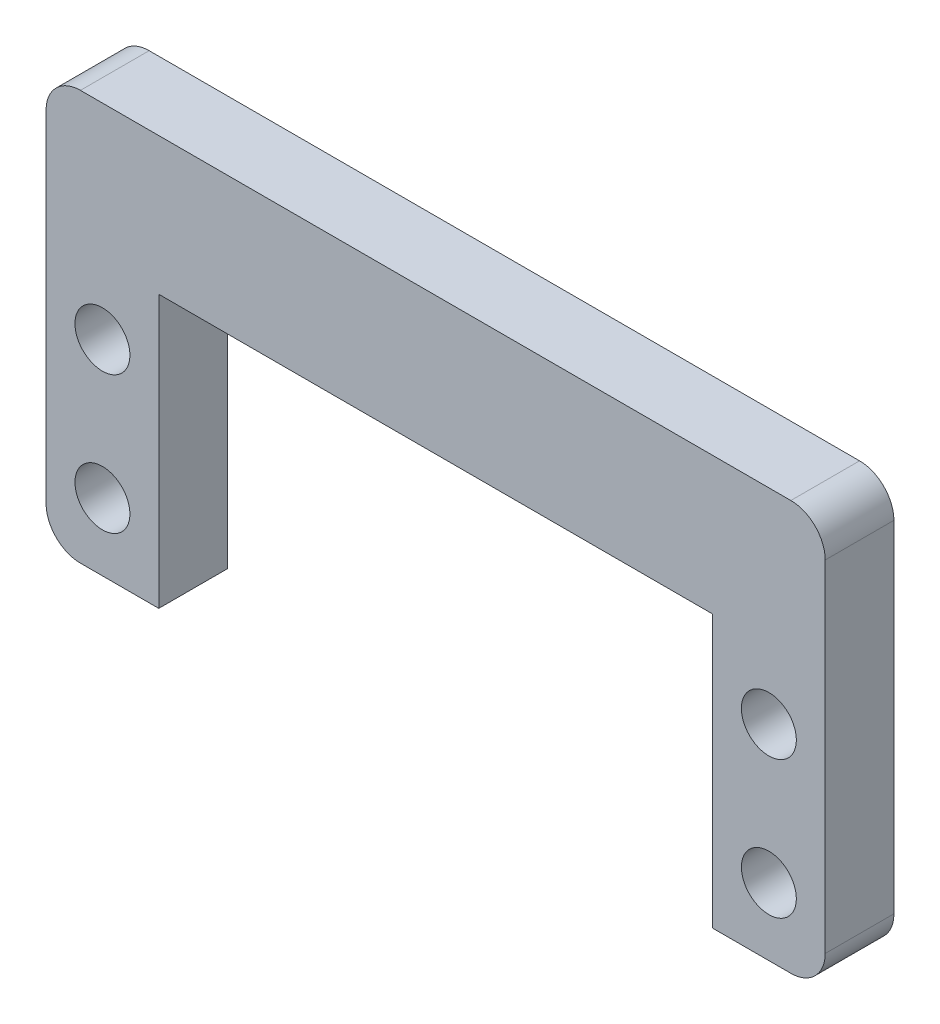
ISO-10303-21;
HEADER;
FILE_DESCRIPTION(('STEP AP214'),'2;1');
FILE_NAME('part.step','',(''),(''),'','','');
FILE_SCHEMA(('AUTOMOTIVE_DESIGN { 1 0 10303 214 1 1 1 1 }'));
ENDSEC;
DATA;
#1=APPLICATION_CONTEXT('core data for automotive mechanical design processes');
#2=APPLICATION_PROTOCOL_DEFINITION('international standard','automotive_design',2000,#1);
#3=PRODUCT_CONTEXT('',#1,'mechanical');
#4=PRODUCT('Part','Part','',(#3));
#5=PRODUCT_RELATED_PRODUCT_CATEGORY('part','',(#4));
#6=PRODUCT_DEFINITION_FORMATION('','',#4);
#7=PRODUCT_DEFINITION_CONTEXT('part definition',#1,'design');
#8=PRODUCT_DEFINITION('design','',#6,#7);
#9=PRODUCT_DEFINITION_SHAPE('','',#8);
#10=(LENGTH_UNIT() NAMED_UNIT(*) SI_UNIT(.MILLI.,.METRE.));
#11=(NAMED_UNIT(*) PLANE_ANGLE_UNIT() SI_UNIT($,.RADIAN.));
#12=(NAMED_UNIT(*) SI_UNIT($,.STERADIAN.) SOLID_ANGLE_UNIT());
#13=UNCERTAINTY_MEASURE_WITH_UNIT(LENGTH_MEASURE(1.E-05),#10,'distance_accuracy_value','');
#14=(GEOMETRIC_REPRESENTATION_CONTEXT(3) GLOBAL_UNCERTAINTY_ASSIGNED_CONTEXT((#13)) GLOBAL_UNIT_ASSIGNED_CONTEXT((#10,
#11,#12)) REPRESENTATION_CONTEXT('',''));
#15=CARTESIAN_POINT('',(0.,0.,0.));
#16=DIRECTION('',(0.,0.,1.));
#17=DIRECTION('',(1.,0.,0.));
#18=AXIS2_PLACEMENT_3D('',#15,#16,#17);
#19=CARTESIAN_POINT('',(-25.85,-7.4,5.));
#20=DIRECTION('',(0.,0.,-1.));
#21=DIRECTION('',(-1.,0.,0.));
#22=AXIS2_PLACEMENT_3D('',#19,#20,#21);
#23=CYLINDRICAL_SURFACE('',#22,2.5);
#24=CARTESIAN_POINT('',(-25.85,-7.4,0.));
#25=DIRECTION('',(0.,0.,1.));
#26=DIRECTION('',(1.,0.,0.));
#27=AXIS2_PLACEMENT_3D('',#24,#25,#26);
#28=CIRCLE('',#27,2.5);
#29=CARTESIAN_POINT('',(-25.85,-9.9,0.));
#30=VERTEX_POINT('',#29);
#31=CARTESIAN_POINT('',(-28.35,-7.39999999999998,0.));
#32=VERTEX_POINT('',#31);
#33=EDGE_CURVE('E164',#30,#32,#28,.F.);
#34=ORIENTED_EDGE('',*,*,#33,.F.);
#35=DIRECTION('',(0.,0.,-1.));
#36=VECTOR('',#35,1.);
#37=CARTESIAN_POINT('',(-25.85,-9.9,5.));
#38=LINE('',#37,#36);
#39=CARTESIAN_POINT('',(-25.85,-9.9,5.));
#40=VERTEX_POINT('',#39);
#41=EDGE_CURVE('E11',#40,#30,#38,.T.);
#42=ORIENTED_EDGE('',*,*,#41,.F.);
#43=CARTESIAN_POINT('',(-25.85,-7.4,5.));
#44=DIRECTION('',(0.,0.,1.));
#45=DIRECTION('',(1.,0.,0.));
#46=AXIS2_PLACEMENT_3D('',#43,#44,#45);
#47=CIRCLE('',#46,2.5);
#48=CARTESIAN_POINT('',(-28.35,-7.39999999999998,5.));
#49=VERTEX_POINT('',#48);
#50=EDGE_CURVE('E208',#40,#49,#47,.F.);
#51=ORIENTED_EDGE('',*,*,#50,.T.);
#52=DIRECTION('',(0.,0.,-1.));
#53=VECTOR('',#52,1.);
#54=CARTESIAN_POINT('',(-28.35,-7.39999999999998,5.));
#55=LINE('',#54,#53);
#56=EDGE_CURVE('E51',#49,#32,#55,.T.);
#57=ORIENTED_EDGE('',*,*,#56,.T.);
#58=EDGE_LOOP('',(#34,#42,#51,#57));
#59=FACE_BOUND('',#58,.T.);
#60=ADVANCED_FACE('F35',(#59),#23,.T.);
#61=CARTESIAN_POINT('',(0.,-9.9,5.));
#62=DIRECTION('',(0.,-1.,0.));
#63=DIRECTION('',(0.,0.,-1.));
#64=AXIS2_PLACEMENT_3D('',#61,#62,#63);
#65=PLANE('',#64);
#66=DIRECTION('',(-1.,0.,0.));
#67=VECTOR('',#66,1.);
#68=CARTESIAN_POINT('',(0.,-9.9,0.));
#69=LINE('',#68,#67);
#70=CARTESIAN_POINT('',(-20.15,-9.9,0.));
#71=VERTEX_POINT('',#70);
#72=EDGE_CURVE('E166',#71,#30,#69,.T.);
#73=ORIENTED_EDGE('',*,*,#72,.F.);
#74=DIRECTION('',(0.,0.,-1.));
#75=VECTOR('',#74,1.);
#76=CARTESIAN_POINT('',(-20.15,-9.9,5.));
#77=LINE('',#76,#75);
#78=CARTESIAN_POINT('',(-20.15,-9.9,5.));
#79=VERTEX_POINT('',#78);
#80=EDGE_CURVE('E43',#79,#71,#77,.T.);
#81=ORIENTED_EDGE('',*,*,#80,.F.);
#82=DIRECTION('',(-1.,0.,0.));
#83=VECTOR('',#82,1.);
#84=CARTESIAN_POINT('',(0.,-9.9,5.));
#85=LINE('',#84,#83);
#86=EDGE_CURVE('E238',#79,#40,#85,.T.);
#87=ORIENTED_EDGE('',*,*,#86,.T.);
#88=ORIENTED_EDGE('',*,*,#41,.T.);
#89=EDGE_LOOP('',(#73,#81,#87,#88));
#90=FACE_BOUND('',#89,.T.);
#91=ADVANCED_FACE('F237',(#90),#65,.T.);
#92=CARTESIAN_POINT('',(-20.15,0.,5.));
#93=DIRECTION('',(-1.,0.,0.));
#94=DIRECTION('',(0.,0.,1.));
#95=AXIS2_PLACEMENT_3D('',#92,#93,#94);
#96=PLANE('',#95);
#97=DIRECTION('',(0.,1.,0.));
#98=VECTOR('',#97,1.);
#99=CARTESIAN_POINT('',(-20.15,0.,0.));
#100=LINE('',#99,#98);
#101=CARTESIAN_POINT('',(-20.15,9.9,0.));
#102=VERTEX_POINT('',#101);
#103=EDGE_CURVE('E169',#71,#102,#100,.T.);
#104=ORIENTED_EDGE('',*,*,#103,.T.);
#105=DIRECTION('',(0.,0.,-1.));
#106=VECTOR('',#105,1.);
#107=CARTESIAN_POINT('',(-20.15,9.9,5.));
#108=LINE('',#107,#106);
#109=CARTESIAN_POINT('',(-20.15,9.9,5.));
#110=VERTEX_POINT('',#109);
#111=EDGE_CURVE('E222',#110,#102,#108,.T.);
#112=ORIENTED_EDGE('',*,*,#111,.F.);
#113=DIRECTION('',(0.,1.,0.));
#114=VECTOR('',#113,1.);
#115=CARTESIAN_POINT('',(-20.15,0.,5.));
#116=LINE('',#115,#114);
#117=EDGE_CURVE('E228',#79,#110,#116,.T.);
#118=ORIENTED_EDGE('',*,*,#117,.F.);
#119=ORIENTED_EDGE('',*,*,#80,.T.);
#120=EDGE_LOOP('',(#104,#112,#118,#119));
#121=FACE_BOUND('',#120,.T.);
#122=ADVANCED_FACE('F226',(#121),#96,.F.);
#123=CARTESIAN_POINT('',(0.,9.9,5.));
#124=DIRECTION('',(0.,-1.,0.));
#125=DIRECTION('',(0.,0.,-1.));
#126=AXIS2_PLACEMENT_3D('',#123,#124,#125);
#127=PLANE('',#126);
#128=DIRECTION('',(-1.,0.,0.));
#129=VECTOR('',#128,1.);
#130=CARTESIAN_POINT('',(0.,9.9,0.));
#131=LINE('',#130,#129);
#132=CARTESIAN_POINT('',(20.15,9.9,0.));
#133=VERTEX_POINT('',#132);
#134=EDGE_CURVE('E172',#133,#102,#131,.T.);
#135=ORIENTED_EDGE('',*,*,#134,.F.);
#136=DIRECTION('',(0.,0.,-1.));
#137=VECTOR('',#136,1.);
#138=CARTESIAN_POINT('',(20.15,9.9,5.));
#139=LINE('',#138,#137);
#140=CARTESIAN_POINT('',(20.15,9.9,5.));
#141=VERTEX_POINT('',#140);
#142=EDGE_CURVE('E220',#141,#133,#139,.T.);
#143=ORIENTED_EDGE('',*,*,#142,.F.);
#144=DIRECTION('',(-1.,0.,0.));
#145=VECTOR('',#144,1.);
#146=CARTESIAN_POINT('',(0.,9.9,5.));
#147=LINE('',#146,#145);
#148=EDGE_CURVE('E458',#141,#110,#147,.T.);
#149=ORIENTED_EDGE('',*,*,#148,.T.);
#150=ORIENTED_EDGE('',*,*,#111,.T.);
#151=EDGE_LOOP('',(#135,#143,#149,#150));
#152=FACE_BOUND('',#151,.T.);
#153=ADVANCED_FACE('F261',(#152),#127,.T.);
#154=CARTESIAN_POINT('',(20.15,0.,5.));
#155=DIRECTION('',(-1.,0.,0.));
#156=DIRECTION('',(0.,0.,1.));
#157=AXIS2_PLACEMENT_3D('',#154,#155,#156);
#158=PLANE('',#157);
#159=DIRECTION('',(0.,1.,0.));
#160=VECTOR('',#159,1.);
#161=CARTESIAN_POINT('',(20.15,0.,0.));
#162=LINE('',#161,#160);
#163=CARTESIAN_POINT('',(20.15,-9.9,0.));
#164=VERTEX_POINT('',#163);
#165=EDGE_CURVE('E175',#164,#133,#162,.T.);
#166=ORIENTED_EDGE('',*,*,#165,.F.);
#167=DIRECTION('',(0.,0.,-1.));
#168=VECTOR('',#167,1.);
#169=CARTESIAN_POINT('',(20.15,-9.9,5.));
#170=LINE('',#169,#168);
#171=CARTESIAN_POINT('',(20.15,-9.9,5.));
#172=VERTEX_POINT('',#171);
#173=EDGE_CURVE('E218',#172,#164,#170,.T.);
#174=ORIENTED_EDGE('',*,*,#173,.F.);
#175=DIRECTION('',(0.,1.,0.));
#176=VECTOR('',#175,1.);
#177=CARTESIAN_POINT('',(20.15,0.,5.));
#178=LINE('',#177,#176);
#179=EDGE_CURVE('E455',#172,#141,#178,.T.);
#180=ORIENTED_EDGE('',*,*,#179,.T.);
#181=ORIENTED_EDGE('',*,*,#142,.T.);
#182=EDGE_LOOP('',(#166,#174,#180,#181));
#183=FACE_BOUND('',#182,.T.);
#184=ADVANCED_FACE('F266',(#183),#158,.T.);
#185=CARTESIAN_POINT('',(0.,-9.9,5.));
#186=DIRECTION('',(0.,1.,0.));
#187=DIRECTION('',(0.,0.,1.));
#188=AXIS2_PLACEMENT_3D('',#185,#186,#187);
#189=PLANE('',#188);
#190=DIRECTION('',(1.,0.,0.));
#191=VECTOR('',#190,1.);
#192=CARTESIAN_POINT('',(0.,-9.9,0.));
#193=LINE('',#192,#191);
#194=CARTESIAN_POINT('',(25.85,-9.9,0.));
#195=VERTEX_POINT('',#194);
#196=EDGE_CURVE('E178',#164,#195,#193,.T.);
#197=ORIENTED_EDGE('',*,*,#196,.T.);
#198=DIRECTION('',(0.,0.,-1.));
#199=VECTOR('',#198,1.);
#200=CARTESIAN_POINT('',(25.85,-9.9,5.));
#201=LINE('',#200,#199);
#202=CARTESIAN_POINT('',(25.85,-9.9,5.));
#203=VERTEX_POINT('',#202);
#204=EDGE_CURVE('E216',#203,#195,#201,.T.);
#205=ORIENTED_EDGE('',*,*,#204,.F.);
#206=DIRECTION('',(1.,0.,0.));
#207=VECTOR('',#206,1.);
#208=CARTESIAN_POINT('',(0.,-9.9,5.));
#209=LINE('',#208,#207);
#210=EDGE_CURVE('E460',#172,#203,#209,.T.);
#211=ORIENTED_EDGE('',*,*,#210,.F.);
#212=ORIENTED_EDGE('',*,*,#173,.T.);
#213=EDGE_LOOP('',(#197,#205,#211,#212));
#214=FACE_BOUND('',#213,.T.);
#215=ADVANCED_FACE('F270',(#214),#189,.F.);
#216=CARTESIAN_POINT('',(25.85,-7.4,5.));
#217=DIRECTION('',(0.,0.,-1.));
#218=DIRECTION('',(-1.,0.,0.));
#219=AXIS2_PLACEMENT_3D('',#216,#217,#218);
#220=CYLINDRICAL_SURFACE('',#219,2.5);
#221=CARTESIAN_POINT('',(25.85,-7.4,0.));
#222=DIRECTION('',(0.,0.,1.));
#223=DIRECTION('',(1.,0.,0.));
#224=AXIS2_PLACEMENT_3D('',#221,#222,#223);
#225=CIRCLE('',#224,2.5);
#226=CARTESIAN_POINT('',(28.35,-7.39999999999998,0.));
#227=VERTEX_POINT('',#226);
#228=EDGE_CURVE('E181',#227,#195,#225,.F.);
#229=ORIENTED_EDGE('',*,*,#228,.F.);
#230=DIRECTION('',(0.,0.,-1.));
#231=VECTOR('',#230,1.);
#232=CARTESIAN_POINT('',(28.35,-7.39999999999998,5.));
#233=LINE('',#232,#231);
#234=CARTESIAN_POINT('',(28.35,-7.39999999999998,5.));
#235=VERTEX_POINT('',#234);
#236=EDGE_CURVE('E214',#235,#227,#233,.T.);
#237=ORIENTED_EDGE('',*,*,#236,.F.);
#238=CARTESIAN_POINT('',(25.85,-7.4,5.));
#239=DIRECTION('',(0.,0.,1.));
#240=DIRECTION('',(1.,0.,0.));
#241=AXIS2_PLACEMENT_3D('',#238,#239,#240);
#242=CIRCLE('',#241,2.5);
#243=EDGE_CURVE('E450',#235,#203,#242,.F.);
#244=ORIENTED_EDGE('',*,*,#243,.T.);
#245=ORIENTED_EDGE('',*,*,#204,.T.);
#246=EDGE_LOOP('',(#229,#237,#244,#245));
#247=FACE_BOUND('',#246,.T.);
#248=ADVANCED_FACE('F274',(#247),#220,.T.);
#249=CARTESIAN_POINT('',(28.35,0.,5.));
#250=DIRECTION('',(-1.,0.,0.));
#251=DIRECTION('',(0.,0.,1.));
#252=AXIS2_PLACEMENT_3D('',#249,#250,#251);
#253=PLANE('',#252);
#254=DIRECTION('',(0.,1.,0.));
#255=VECTOR('',#254,1.);
#256=CARTESIAN_POINT('',(28.35,0.,0.));
#257=LINE('',#256,#255);
#258=CARTESIAN_POINT('',(28.35,17.4,0.));
#259=VERTEX_POINT('',#258);
#260=EDGE_CURVE('E184',#227,#259,#257,.T.);
#261=ORIENTED_EDGE('',*,*,#260,.T.);
#262=DIRECTION('',(0.,0.,-1.));
#263=VECTOR('',#262,1.);
#264=CARTESIAN_POINT('',(28.35,17.4,5.));
#265=LINE('',#264,#263);
#266=CARTESIAN_POINT('',(28.35,17.4,5.));
#267=VERTEX_POINT('',#266);
#268=EDGE_CURVE('E212',#267,#259,#265,.T.);
#269=ORIENTED_EDGE('',*,*,#268,.F.);
#270=DIRECTION('',(0.,1.,0.));
#271=VECTOR('',#270,1.);
#272=CARTESIAN_POINT('',(28.35,0.,5.));
#273=LINE('',#272,#271);
#274=EDGE_CURVE('E467',#235,#267,#273,.T.);
#275=ORIENTED_EDGE('',*,*,#274,.F.);
#276=ORIENTED_EDGE('',*,*,#236,.T.);
#277=EDGE_LOOP('',(#261,#269,#275,#276));
#278=FACE_BOUND('',#277,.T.);
#279=ADVANCED_FACE('F278',(#278),#253,.F.);
#280=CARTESIAN_POINT('',(25.85,17.4,5.));
#281=DIRECTION('',(0.,0.,-1.));
#282=DIRECTION('',(-1.,0.,0.));
#283=AXIS2_PLACEMENT_3D('',#280,#281,#282);
#284=CYLINDRICAL_SURFACE('',#283,2.5);
#285=CARTESIAN_POINT('',(25.85,17.4,0.));
#286=DIRECTION('',(0.,0.,1.));
#287=DIRECTION('',(1.,0.,0.));
#288=AXIS2_PLACEMENT_3D('',#285,#286,#287);
#289=CIRCLE('',#288,2.5);
#290=CARTESIAN_POINT('',(25.85,19.9,0.));
#291=VERTEX_POINT('',#290);
#292=EDGE_CURVE('E187',#291,#259,#289,.F.);
#293=ORIENTED_EDGE('',*,*,#292,.F.);
#294=DIRECTION('',(0.,0.,-1.));
#295=VECTOR('',#294,1.);
#296=CARTESIAN_POINT('',(25.85,19.9,5.));
#297=LINE('',#296,#295);
#298=CARTESIAN_POINT('',(25.85,19.9,5.));
#299=VERTEX_POINT('',#298);
#300=EDGE_CURVE('E134',#299,#291,#297,.T.);
#301=ORIENTED_EDGE('',*,*,#300,.F.);
#302=CARTESIAN_POINT('',(25.85,17.4,5.));
#303=DIRECTION('',(0.,0.,1.));
#304=DIRECTION('',(1.,0.,0.));
#305=AXIS2_PLACEMENT_3D('',#302,#303,#304);
#306=CIRCLE('',#305,2.5);
#307=EDGE_CURVE('E144',#299,#267,#306,.F.);
#308=ORIENTED_EDGE('',*,*,#307,.T.);
#309=ORIENTED_EDGE('',*,*,#268,.T.);
#310=EDGE_LOOP('',(#293,#301,#308,#309));
#311=FACE_BOUND('',#310,.T.);
#312=ADVANCED_FACE('F282',(#311),#284,.T.);
#313=CARTESIAN_POINT('',(0.,19.9,5.));
#314=DIRECTION('',(0.,1.,0.));
#315=DIRECTION('',(0.,0.,1.));
#316=AXIS2_PLACEMENT_3D('',#313,#314,#315);
#317=PLANE('',#316);
#318=DIRECTION('',(1.,0.,0.));
#319=VECTOR('',#318,1.);
#320=CARTESIAN_POINT('',(0.,19.9,0.));
#321=LINE('',#320,#319);
#322=CARTESIAN_POINT('',(-25.85,19.9,0.));
#323=VERTEX_POINT('',#322);
#324=EDGE_CURVE('E130',#323,#291,#321,.T.);
#325=ORIENTED_EDGE('',*,*,#324,.F.);
#326=DIRECTION('',(0.,0.,-1.));
#327=VECTOR('',#326,1.);
#328=CARTESIAN_POINT('',(-25.85,19.9,5.));
#329=LINE('',#328,#327);
#330=CARTESIAN_POINT('',(-25.85,19.9,5.));
#331=VERTEX_POINT('',#330);
#332=EDGE_CURVE('E125',#331,#323,#329,.T.);
#333=ORIENTED_EDGE('',*,*,#332,.F.);
#334=DIRECTION('',(1.,0.,0.));
#335=VECTOR('',#334,1.);
#336=CARTESIAN_POINT('',(0.,19.9,5.));
#337=LINE('',#336,#335);
#338=EDGE_CURVE('E128',#331,#299,#337,.T.);
#339=ORIENTED_EDGE('',*,*,#338,.T.);
#340=ORIENTED_EDGE('',*,*,#300,.T.);
#341=EDGE_LOOP('',(#325,#333,#339,#340));
#342=FACE_BOUND('',#341,.T.);
#343=ADVANCED_FACE('F127',(#342),#317,.T.);
#344=CARTESIAN_POINT('',(-25.85,17.4,5.));
#345=DIRECTION('',(0.,0.,-1.));
#346=DIRECTION('',(-1.,0.,0.));
#347=AXIS2_PLACEMENT_3D('',#344,#345,#346);
#348=CYLINDRICAL_SURFACE('',#347,2.5);
#349=CARTESIAN_POINT('',(-25.85,17.4,0.));
#350=DIRECTION('',(0.,0.,1.));
#351=DIRECTION('',(1.,0.,0.));
#352=AXIS2_PLACEMENT_3D('',#349,#350,#351);
#353=CIRCLE('',#352,2.5);
#354=CARTESIAN_POINT('',(-28.35,17.4,0.));
#355=VERTEX_POINT('',#354);
#356=EDGE_CURVE('E191',#355,#323,#353,.F.);
#357=ORIENTED_EDGE('',*,*,#356,.F.);
#358=DIRECTION('',(0.,0.,-1.));
#359=VECTOR('',#358,1.);
#360=CARTESIAN_POINT('',(-28.35,17.4,5.));
#361=LINE('',#360,#359);
#362=CARTESIAN_POINT('',(-28.35,17.4,5.));
#363=VERTEX_POINT('',#362);
#364=EDGE_CURVE('E88',#363,#355,#361,.T.);
#365=ORIENTED_EDGE('',*,*,#364,.F.);
#366=CARTESIAN_POINT('',(-25.85,17.4,5.));
#367=DIRECTION('',(0.,0.,1.));
#368=DIRECTION('',(1.,0.,0.));
#369=AXIS2_PLACEMENT_3D('',#366,#367,#368);
#370=CIRCLE('',#369,2.5);
#371=EDGE_CURVE('E142',#363,#331,#370,.F.);
#372=ORIENTED_EDGE('',*,*,#371,.T.);
#373=ORIENTED_EDGE('',*,*,#332,.T.);
#374=EDGE_LOOP('',(#357,#365,#372,#373));
#375=FACE_BOUND('',#374,.T.);
#376=ADVANCED_FACE('F146',(#375),#348,.T.);
#377=CARTESIAN_POINT('',(24.25,5.,5.));
#378=DIRECTION('',(0.,0.,-1.));
#379=DIRECTION('',(-1.,0.,0.));
#380=AXIS2_PLACEMENT_3D('',#377,#378,#379);
#381=CYLINDRICAL_SURFACE('',#380,1.99999999999997);
#382=CARTESIAN_POINT('',(24.25,5.,5.));
#383=DIRECTION('',(0.,0.,1.));
#384=DIRECTION('',(1.,0.,0.));
#385=AXIS2_PLACEMENT_3D('',#382,#383,#384);
#386=CIRCLE('',#385,1.99999999999997);
#387=CARTESIAN_POINT('',(26.25,5.,5.));
#388=VERTEX_POINT('',#387);
#389=EDGE_CURVE('E158',#388,#388,#386,.T.);
#390=ORIENTED_EDGE('',*,*,#389,.T.);
#391=EDGE_LOOP('',(#390));
#392=FACE_BOUND('',#391,.T.);
#393=CARTESIAN_POINT('',(24.25,5.,0.));
#394=DIRECTION('',(0.,0.,1.));
#395=DIRECTION('',(1.,0.,0.));
#396=AXIS2_PLACEMENT_3D('',#393,#394,#395);
#397=CIRCLE('',#396,1.99999999999997);
#398=CARTESIAN_POINT('',(26.25,5.,0.));
#399=VERTEX_POINT('',#398);
#400=EDGE_CURVE('E202',#399,#399,#397,.T.);
#401=ORIENTED_EDGE('',*,*,#400,.F.);
#402=EDGE_LOOP('',(#401));
#403=FACE_BOUND('',#402,.T.);
#404=ADVANCED_FACE('F289',(#392,#403),#381,.F.);
#405=CARTESIAN_POINT('',(-24.25,5.,5.));
#406=DIRECTION('',(0.,0.,-1.));
#407=DIRECTION('',(-1.,0.,0.));
#408=AXIS2_PLACEMENT_3D('',#405,#406,#407);
#409=CYLINDRICAL_SURFACE('',#408,1.99999999999997);
#410=CARTESIAN_POINT('',(-24.25,5.,5.));
#411=DIRECTION('',(0.,0.,1.));
#412=DIRECTION('',(1.,0.,0.));
#413=AXIS2_PLACEMENT_3D('',#410,#411,#412);
#414=CIRCLE('',#413,1.99999999999997);
#415=CARTESIAN_POINT('',(-22.25,5.,5.));
#416=VERTEX_POINT('',#415);
#417=EDGE_CURVE('E155',#416,#416,#414,.T.);
#418=ORIENTED_EDGE('',*,*,#417,.T.);
#419=EDGE_LOOP('',(#418));
#420=FACE_BOUND('',#419,.T.);
#421=CARTESIAN_POINT('',(-24.25,5.,0.));
#422=DIRECTION('',(0.,0.,1.));
#423=DIRECTION('',(1.,0.,0.));
#424=AXIS2_PLACEMENT_3D('',#421,#422,#423);
#425=CIRCLE('',#424,1.99999999999997);
#426=CARTESIAN_POINT('',(-22.25,5.,0.));
#427=VERTEX_POINT('',#426);
#428=EDGE_CURVE('E199',#427,#427,#425,.T.);
#429=ORIENTED_EDGE('',*,*,#428,.F.);
#430=EDGE_LOOP('',(#429));
#431=FACE_BOUND('',#430,.T.);
#432=ADVANCED_FACE('F250',(#420,#431),#409,.F.);
#433=CARTESIAN_POINT('',(-24.25,-5.,5.));
#434=DIRECTION('',(0.,0.,-1.));
#435=DIRECTION('',(-1.,0.,0.));
#436=AXIS2_PLACEMENT_3D('',#433,#434,#435);
#437=CYLINDRICAL_SURFACE('',#436,2.);
#438=CARTESIAN_POINT('',(-24.25,-5.,5.));
#439=DIRECTION('',(0.,0.,1.));
#440=DIRECTION('',(1.,0.,0.));
#441=AXIS2_PLACEMENT_3D('',#438,#439,#440);
#442=CIRCLE('',#441,2.);
#443=CARTESIAN_POINT('',(-22.25,-5.,5.));
#444=VERTEX_POINT('',#443);
#445=EDGE_CURVE('E149',#444,#444,#442,.T.);
#446=ORIENTED_EDGE('',*,*,#445,.T.);
#447=EDGE_LOOP('',(#446));
#448=FACE_BOUND('',#447,.T.);
#449=CARTESIAN_POINT('',(-24.25,-5.,0.));
#450=DIRECTION('',(0.,0.,1.));
#451=DIRECTION('',(1.,0.,0.));
#452=AXIS2_PLACEMENT_3D('',#449,#450,#451);
#453=CIRCLE('',#452,2.);
#454=CARTESIAN_POINT('',(-22.25,-5.,0.));
#455=VERTEX_POINT('',#454);
#456=EDGE_CURVE('E196',#455,#455,#453,.T.);
#457=ORIENTED_EDGE('',*,*,#456,.F.);
#458=EDGE_LOOP('',(#457));
#459=FACE_BOUND('',#458,.T.);
#460=ADVANCED_FACE('F242',(#448,#459),#437,.F.);
#461=CARTESIAN_POINT('',(-28.35,0.,5.));
#462=DIRECTION('',(-1.,0.,0.));
#463=DIRECTION('',(0.,0.,1.));
#464=AXIS2_PLACEMENT_3D('',#461,#462,#463);
#465=PLANE('',#464);
#466=DIRECTION('',(0.,1.,0.));
#467=VECTOR('',#466,1.);
#468=CARTESIAN_POINT('',(-28.35,0.,0.));
#469=LINE('',#468,#467);
#470=EDGE_CURVE('E193',#32,#355,#469,.T.);
#471=ORIENTED_EDGE('',*,*,#470,.F.);
#472=ORIENTED_EDGE('',*,*,#56,.F.);
#473=DIRECTION('',(0.,1.,0.));
#474=VECTOR('',#473,1.);
#475=CARTESIAN_POINT('',(-28.35,0.,5.));
#476=LINE('',#475,#474);
#477=EDGE_CURVE('E147',#49,#363,#476,.T.);
#478=ORIENTED_EDGE('',*,*,#477,.T.);
#479=ORIENTED_EDGE('',*,*,#364,.T.);
#480=EDGE_LOOP('',(#471,#472,#478,#479));
#481=FACE_BOUND('',#480,.T.);
#482=ADVANCED_FACE('F239',(#481),#465,.T.);
#483=CARTESIAN_POINT('',(24.25,-5.,5.));
#484=DIRECTION('',(0.,0.,-1.));
#485=DIRECTION('',(-1.,0.,0.));
#486=AXIS2_PLACEMENT_3D('',#483,#484,#485);
#487=CYLINDRICAL_SURFACE('',#486,2.);
#488=CARTESIAN_POINT('',(24.25,-5.,5.));
#489=DIRECTION('',(0.,0.,1.));
#490=DIRECTION('',(1.,0.,0.));
#491=AXIS2_PLACEMENT_3D('',#488,#489,#490);
#492=CIRCLE('',#491,2.);
#493=CARTESIAN_POINT('',(26.25,-5.,5.));
#494=VERTEX_POINT('',#493);
#495=EDGE_CURVE('E161',#494,#494,#492,.T.);
#496=ORIENTED_EDGE('',*,*,#495,.T.);
#497=EDGE_LOOP('',(#496));
#498=FACE_BOUND('',#497,.T.);
#499=CARTESIAN_POINT('',(24.25,-5.,0.));
#500=DIRECTION('',(0.,0.,1.));
#501=DIRECTION('',(1.,0.,0.));
#502=AXIS2_PLACEMENT_3D('',#499,#500,#501);
#503=CIRCLE('',#502,2.);
#504=CARTESIAN_POINT('',(26.25,-5.,0.));
#505=VERTEX_POINT('',#504);
#506=EDGE_CURVE('E205',#505,#505,#503,.T.);
#507=ORIENTED_EDGE('',*,*,#506,.F.);
#508=EDGE_LOOP('',(#507));
#509=FACE_BOUND('',#508,.T.);
#510=ADVANCED_FACE('F241',(#498,#509),#487,.F.);
#511=CARTESIAN_POINT('',(0.,0.,5.));
#512=DIRECTION('',(0.,0.,1.));
#513=DIRECTION('',(1.,0.,0.));
#514=AXIS2_PLACEMENT_3D('',#511,#512,#513);
#515=PLANE('',#514);
#516=ORIENTED_EDGE('',*,*,#50,.F.);
#517=ORIENTED_EDGE('',*,*,#86,.F.);
#518=ORIENTED_EDGE('',*,*,#117,.T.);
#519=ORIENTED_EDGE('',*,*,#148,.F.);
#520=ORIENTED_EDGE('',*,*,#179,.F.);
#521=ORIENTED_EDGE('',*,*,#210,.T.);
#522=ORIENTED_EDGE('',*,*,#243,.F.);
#523=ORIENTED_EDGE('',*,*,#274,.T.);
#524=ORIENTED_EDGE('',*,*,#307,.F.);
#525=ORIENTED_EDGE('',*,*,#338,.F.);
#526=ORIENTED_EDGE('',*,*,#371,.F.);
#527=ORIENTED_EDGE('',*,*,#477,.F.);
#528=EDGE_LOOP('',(#516,#517,#518,#519,#520,#521,#522,#523,#524,#525,#526,#527));
#529=FACE_BOUND('',#528,.T.);
#530=ORIENTED_EDGE('',*,*,#445,.F.);
#531=EDGE_LOOP('',(#530));
#532=FACE_BOUND('',#531,.T.);
#533=ORIENTED_EDGE('',*,*,#417,.F.);
#534=EDGE_LOOP('',(#533));
#535=FACE_BOUND('',#534,.T.);
#536=ORIENTED_EDGE('',*,*,#389,.F.);
#537=EDGE_LOOP('',(#536));
#538=FACE_BOUND('',#537,.T.);
#539=ORIENTED_EDGE('',*,*,#495,.F.);
#540=EDGE_LOOP('',(#539));
#541=FACE_BOUND('',#540,.T.);
#542=ADVANCED_FACE('F139',(#529,#532,#535,#538,#541),#515,.T.);
#543=CARTESIAN_POINT('',(0.,0.,0.));
#544=DIRECTION('',(0.,0.,1.));
#545=DIRECTION('',(1.,0.,0.));
#546=AXIS2_PLACEMENT_3D('',#543,#544,#545);
#547=PLANE('',#546);
#548=ORIENTED_EDGE('',*,*,#33,.T.);
#549=ORIENTED_EDGE('',*,*,#470,.T.);
#550=ORIENTED_EDGE('',*,*,#356,.T.);
#551=ORIENTED_EDGE('',*,*,#324,.T.);
#552=ORIENTED_EDGE('',*,*,#292,.T.);
#553=ORIENTED_EDGE('',*,*,#260,.F.);
#554=ORIENTED_EDGE('',*,*,#228,.T.);
#555=ORIENTED_EDGE('',*,*,#196,.F.);
#556=ORIENTED_EDGE('',*,*,#165,.T.);
#557=ORIENTED_EDGE('',*,*,#134,.T.);
#558=ORIENTED_EDGE('',*,*,#103,.F.);
#559=ORIENTED_EDGE('',*,*,#72,.T.);
#560=EDGE_LOOP('',(#548,#549,#550,#551,#552,#553,#554,#555,#556,#557,#558,#559));
#561=FACE_BOUND('',#560,.T.);
#562=ORIENTED_EDGE('',*,*,#456,.T.);
#563=EDGE_LOOP('',(#562));
#564=FACE_BOUND('',#563,.T.);
#565=ORIENTED_EDGE('',*,*,#428,.T.);
#566=EDGE_LOOP('',(#565));
#567=FACE_BOUND('',#566,.T.);
#568=ORIENTED_EDGE('',*,*,#400,.T.);
#569=EDGE_LOOP('',(#568));
#570=FACE_BOUND('',#569,.T.);
#571=ORIENTED_EDGE('',*,*,#506,.T.);
#572=EDGE_LOOP('',(#571));
#573=FACE_BOUND('',#572,.T.);
#574=ADVANCED_FACE('F234',(#561,#564,#567,#570,#573),#547,.F.);
#575=CLOSED_SHELL('',(#60,#91,#122,#153,#184,#215,#248,#279,#312,#343,#376,#404,#432,#460,#482,
#510,#542,#574));
#576=MANIFOLD_SOLID_BREP('B2',#575);
#577=ADVANCED_BREP_SHAPE_REPRESENTATION('',(#18,#576),#14);
#578=SHAPE_DEFINITION_REPRESENTATION(#9,#577);
ENDSEC;
END-ISO-10303-21;
